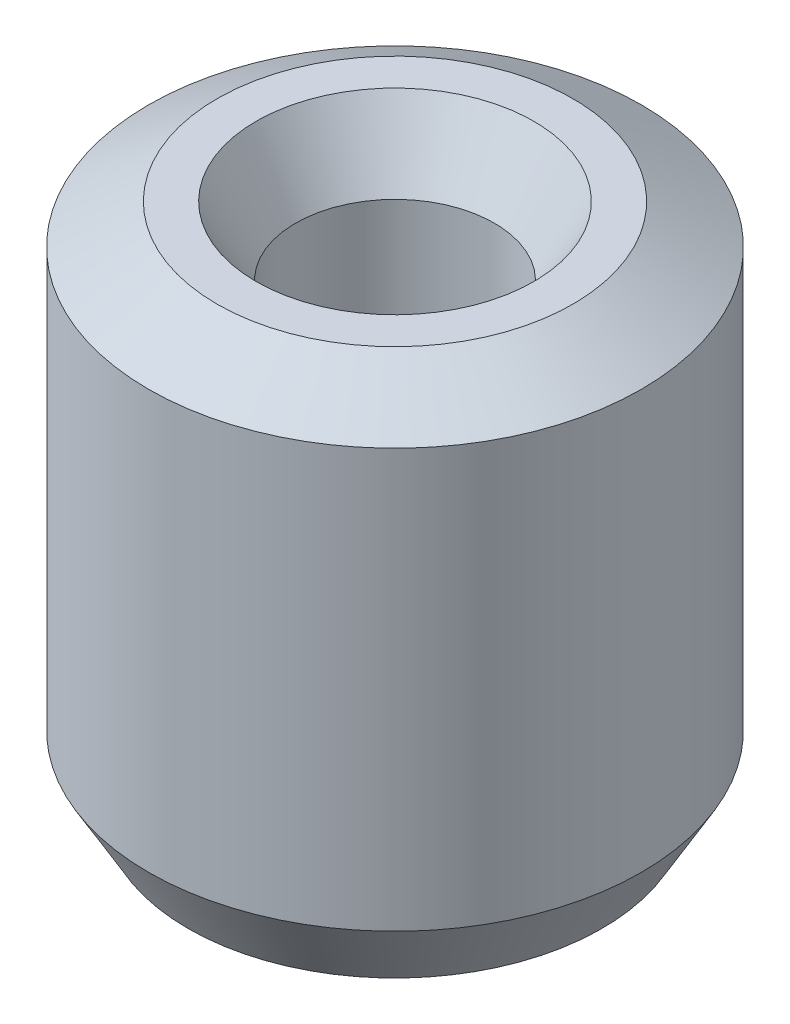
ISO-10303-21;
HEADER;
FILE_DESCRIPTION(('STEP AP214'),'2;1');
FILE_NAME('part.step','',(''),(''),'','','');
FILE_SCHEMA(('AUTOMOTIVE_DESIGN { 1 0 10303 214 1 1 1 1 }'));
ENDSEC;
DATA;
#1=APPLICATION_CONTEXT('core data for automotive mechanical design processes');
#2=APPLICATION_PROTOCOL_DEFINITION('international standard','automotive_design',2000,#1);
#3=PRODUCT_CONTEXT('',#1,'mechanical');
#4=PRODUCT('Part','Part','',(#3));
#5=PRODUCT_RELATED_PRODUCT_CATEGORY('part','',(#4));
#6=PRODUCT_DEFINITION_FORMATION('','',#4);
#7=PRODUCT_DEFINITION_CONTEXT('part definition',#1,'design');
#8=PRODUCT_DEFINITION('design','',#6,#7);
#9=PRODUCT_DEFINITION_SHAPE('','',#8);
#10=(LENGTH_UNIT() NAMED_UNIT(*) SI_UNIT(.MILLI.,.METRE.));
#11=(NAMED_UNIT(*) PLANE_ANGLE_UNIT() SI_UNIT($,.RADIAN.));
#12=(NAMED_UNIT(*) SI_UNIT($,.STERADIAN.) SOLID_ANGLE_UNIT());
#13=UNCERTAINTY_MEASURE_WITH_UNIT(LENGTH_MEASURE(1.E-05),#10,'distance_accuracy_value','');
#14=(GEOMETRIC_REPRESENTATION_CONTEXT(3) GLOBAL_UNCERTAINTY_ASSIGNED_CONTEXT((#13)) GLOBAL_UNIT_ASSIGNED_CONTEXT((#10,
#11,#12)) REPRESENTATION_CONTEXT('',''));
#15=CARTESIAN_POINT('',(0.,0.,0.));
#16=DIRECTION('',(0.,0.,1.));
#17=DIRECTION('',(1.,0.,0.));
#18=AXIS2_PLACEMENT_3D('',#15,#16,#17);
#19=CARTESIAN_POINT('',(0.,37.3805660430047,0.));
#20=DIRECTION('',(0.,-1.,0.));
#21=DIRECTION('',(0.,0.,-1.));
#22=AXIS2_PLACEMENT_3D('',#19,#20,#21);
#23=CYLINDRICAL_SURFACE('',#22,17.5);
#24=CARTESIAN_POINT('',(0.,4.8609349436524,0.));
#25=DIRECTION('',(0.,1.,0.));
#26=DIRECTION('',(0.,0.,1.));
#27=AXIS2_PLACEMENT_3D('',#24,#25,#26);
#28=CIRCLE('',#27,17.5);
#29=CARTESIAN_POINT('',(0.,4.8609349436524,17.5));
#30=VERTEX_POINT('',#29);
#31=EDGE_CURVE('E10',#30,#30,#28,.T.);
#32=ORIENTED_EDGE('',*,*,#31,.T.);
#33=EDGE_LOOP('',(#32));
#34=FACE_BOUND('',#33,.T.);
#35=CARTESIAN_POINT('',(0.,34.5741039447737,0.));
#36=DIRECTION('',(0.,1.,0.));
#37=DIRECTION('',(0.,0.,1.));
#38=AXIS2_PLACEMENT_3D('',#35,#36,#37);
#39=CIRCLE('',#38,17.5);
#40=CARTESIAN_POINT('',(0.,34.5741039447737,17.5));
#41=VERTEX_POINT('',#40);
#42=EDGE_CURVE('E50',#41,#41,#39,.F.);
#43=ORIENTED_EDGE('',*,*,#42,.T.);
#44=EDGE_LOOP('',(#43));
#45=FACE_BOUND('',#44,.T.);
#46=ADVANCED_FACE('F39',(#34,#45),#23,.T.);
#47=CARTESIAN_POINT('',(0.,37.3805660430047,0.));
#48=DIRECTION('',(0.,1.,0.));
#49=DIRECTION('',(0.,0.,1.));
#50=AXIS2_PLACEMENT_3D('',#47,#48,#49);
#51=PLANE('',#50);
#52=CARTESIAN_POINT('',(0.,37.3805660430047,0.));
#53=DIRECTION('',(0.,1.,0.));
#54=DIRECTION('',(0.,0.,1.));
#55=AXIS2_PLACEMENT_3D('',#52,#53,#54);
#56=CIRCLE('',#55,9.86287230093615);
#57=CARTESIAN_POINT('',(0.,37.3805660430047,9.86287230093615));
#58=VERTEX_POINT('',#57);
#59=EDGE_CURVE('E58',#58,#58,#56,.F.);
#60=ORIENTED_EDGE('',*,*,#59,.T.);
#61=EDGE_LOOP('',(#60));
#62=FACE_BOUND('',#61,.T.);
#63=CARTESIAN_POINT('',(0.,37.3805660430047,0.));
#64=DIRECTION('',(0.,1.,0.));
#65=DIRECTION('',(0.,0.,1.));
#66=AXIS2_PLACEMENT_3D('',#63,#64,#65);
#67=CIRCLE('',#66,12.6390650563476);
#68=CARTESIAN_POINT('',(0.,37.3805660430047,12.6390650563476));
#69=VERTEX_POINT('',#68);
#70=EDGE_CURVE('E61',#69,#69,#67,.T.);
#71=ORIENTED_EDGE('',*,*,#70,.T.);
#72=EDGE_LOOP('',(#71));
#73=FACE_BOUND('',#72,.T.);
#74=ADVANCED_FACE('F88',(#62,#73),#51,.T.);
#75=CARTESIAN_POINT('',(0.,0.,0.));
#76=DIRECTION('',(0.,1.,0.));
#77=DIRECTION('',(0.,0.,1.));
#78=AXIS2_PLACEMENT_3D('',#75,#76,#77);
#79=PLANE('',#78);
#80=CARTESIAN_POINT('',(0.,0.,0.));
#81=DIRECTION('',(0.,1.,0.));
#82=DIRECTION('',(0.,0.,1.));
#83=AXIS2_PLACEMENT_3D('',#80,#81,#82);
#84=CIRCLE('',#83,11.9173451463576);
#85=CARTESIAN_POINT('',(0.,0.,11.9173451463576));
#86=VERTEX_POINT('',#85);
#87=EDGE_CURVE('E51',#86,#86,#84,.T.);
#88=ORIENTED_EDGE('',*,*,#87,.T.);
#89=EDGE_LOOP('',(#88));
#90=FACE_BOUND('',#89,.T.);
#91=CARTESIAN_POINT('',(0.,0.,0.));
#92=DIRECTION('',(0.,1.,0.));
#93=DIRECTION('',(0.,0.,1.));
#94=AXIS2_PLACEMENT_3D('',#91,#92,#93);
#95=CIRCLE('',#94,14.693537901769);
#96=CARTESIAN_POINT('',(0.,0.,14.693537901769));
#97=VERTEX_POINT('',#96);
#98=EDGE_CURVE('E54',#97,#97,#95,.F.);
#99=ORIENTED_EDGE('',*,*,#98,.T.);
#100=EDGE_LOOP('',(#99));
#101=FACE_BOUND('',#100,.T.);
#102=ADVANCED_FACE('F83',(#90,#101),#79,.F.);
#103=CARTESIAN_POINT('',(0.,37.3805660430047,0.));
#104=DIRECTION('',(0.,-1.,0.));
#105=DIRECTION('',(0.,0.,-1.));
#106=AXIS2_PLACEMENT_3D('',#103,#104,#105);
#107=CYLINDRICAL_SURFACE('',#106,7.05641020270516);
#108=CARTESIAN_POINT('',(0.,32.5196310993523,0.));
#109=DIRECTION('',(0.,1.,0.));
#110=DIRECTION('',(0.,0.,1.));
#111=AXIS2_PLACEMENT_3D('',#108,#109,#110);
#112=CIRCLE('',#111,7.05641020270516);
#113=CARTESIAN_POINT('',(0.,32.5196310993523,7.05641020270516));
#114=VERTEX_POINT('',#113);
#115=EDGE_CURVE('E67',#114,#114,#112,.T.);
#116=ORIENTED_EDGE('',*,*,#115,.T.);
#117=EDGE_LOOP('',(#116));
#118=FACE_BOUND('',#117,.T.);
#119=CARTESIAN_POINT('',(0.,2.806462098231,0.));
#120=DIRECTION('',(0.,1.,0.));
#121=DIRECTION('',(0.,0.,1.));
#122=AXIS2_PLACEMENT_3D('',#119,#120,#121);
#123=CIRCLE('',#122,7.05641020270516);
#124=CARTESIAN_POINT('',(0.,2.806462098231,7.05641020270516));
#125=VERTEX_POINT('',#124);
#126=EDGE_CURVE('E69',#125,#125,#123,.F.);
#127=ORIENTED_EDGE('',*,*,#126,.T.);
#128=EDGE_LOOP('',(#127));
#129=FACE_BOUND('',#128,.T.);
#130=ADVANCED_FACE('F71',(#118,#129),#107,.F.);
#131=CARTESIAN_POINT('',(0.,32.5196310993523,0.));
#132=DIRECTION('',(0.,1.,0.));
#133=DIRECTION('',(0.,0.,1.));
#134=AXIS2_PLACEMENT_3D('',#131,#132,#133);
#135=CONICAL_SURFACE('',#134,7.05641020270516,0.523598775598301);
#136=ORIENTED_EDGE('',*,*,#59,.F.);
#137=EDGE_LOOP('',(#136));
#138=FACE_BOUND('',#137,.T.);
#139=ORIENTED_EDGE('',*,*,#115,.F.);
#140=EDGE_LOOP('',(#139));
#141=FACE_BOUND('',#140,.T.);
#142=ADVANCED_FACE('F77',(#138,#141),#135,.F.);
#143=CARTESIAN_POINT('',(0.,0.,0.));
#144=DIRECTION('',(0.,-1.,0.));
#145=DIRECTION('',(0.,0.,-1.));
#146=AXIS2_PLACEMENT_3D('',#143,#144,#145);
#147=CONICAL_SURFACE('',#146,11.9173451463576,1.04719755119659);
#148=ORIENTED_EDGE('',*,*,#126,.F.);
#149=EDGE_LOOP('',(#148));
#150=FACE_BOUND('',#149,.T.);
#151=ORIENTED_EDGE('',*,*,#87,.F.);
#152=EDGE_LOOP('',(#151));
#153=FACE_BOUND('',#152,.T.);
#154=ADVANCED_FACE('F73',(#150,#153),#147,.F.);
#155=CARTESIAN_POINT('',(0.,4.8609349436524,0.));
#156=DIRECTION('',(0.,1.,0.));
#157=DIRECTION('',(0.,0.,1.));
#158=AXIS2_PLACEMENT_3D('',#155,#156,#157);
#159=CONICAL_SURFACE('',#158,17.5,0.523598775598302);
#160=ORIENTED_EDGE('',*,*,#98,.F.);
#161=EDGE_LOOP('',(#160));
#162=FACE_BOUND('',#161,.T.);
#163=ORIENTED_EDGE('',*,*,#31,.F.);
#164=EDGE_LOOP('',(#163));
#165=FACE_BOUND('',#164,.T.);
#166=ADVANCED_FACE('F76',(#162,#165),#159,.T.);
#167=CARTESIAN_POINT('',(0.,37.3805660430047,0.));
#168=DIRECTION('',(0.,-1.,0.));
#169=DIRECTION('',(0.,0.,-1.));
#170=AXIS2_PLACEMENT_3D('',#167,#168,#169);
#171=CONICAL_SURFACE('',#170,12.6390650563476,1.04719755119659);
#172=ORIENTED_EDGE('',*,*,#42,.F.);
#173=EDGE_LOOP('',(#172));
#174=FACE_BOUND('',#173,.T.);
#175=ORIENTED_EDGE('',*,*,#70,.F.);
#176=EDGE_LOOP('',(#175));
#177=FACE_BOUND('',#176,.T.);
#178=ADVANCED_FACE('F45',(#174,#177),#171,.T.);
#179=CLOSED_SHELL('',(#46,#74,#102,#130,#142,#154,#166,#178));
#180=MANIFOLD_SOLID_BREP('B2',#179);
#181=ADVANCED_BREP_SHAPE_REPRESENTATION('',(#18,#180),#14);
#182=SHAPE_DEFINITION_REPRESENTATION(#9,#181);
ENDSEC;
END-ISO-10303-21;
